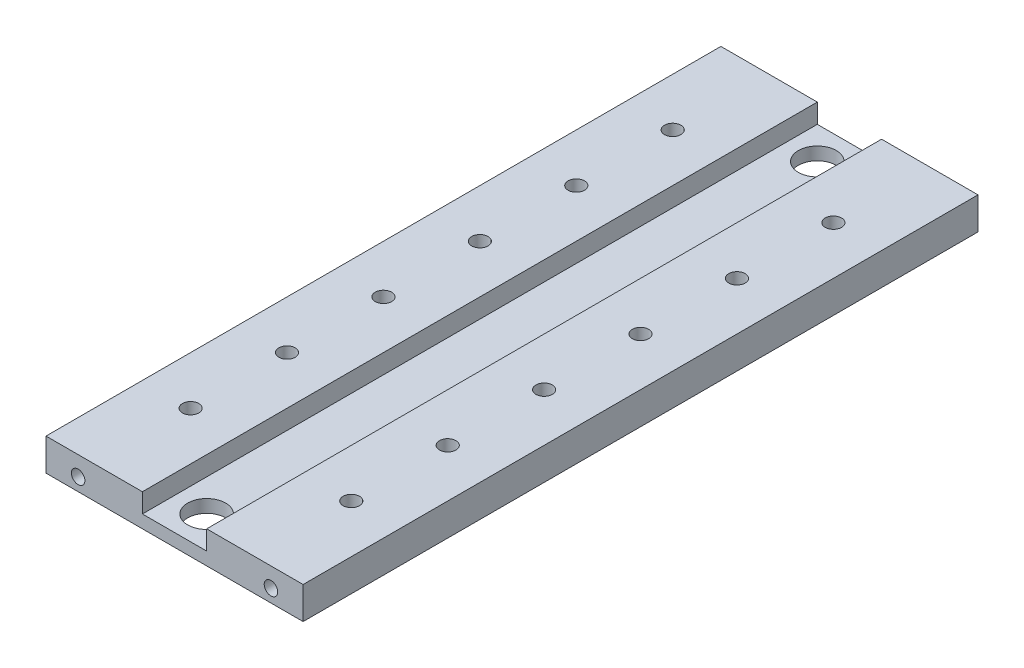
ISO-10303-21;
HEADER;
FILE_DESCRIPTION(('STEP AP214'),'2;1');
FILE_NAME('part.step','',(''),(''),'','','');
FILE_SCHEMA(('AUTOMOTIVE_DESIGN { 1 0 10303 214 1 1 1 1 }'));
ENDSEC;
DATA;
#1=APPLICATION_CONTEXT('core data for automotive mechanical design processes');
#2=APPLICATION_PROTOCOL_DEFINITION('international standard','automotive_design',2000,#1);
#3=PRODUCT_CONTEXT('',#1,'mechanical');
#4=PRODUCT('Part','Part','',(#3));
#5=PRODUCT_RELATED_PRODUCT_CATEGORY('part','',(#4));
#6=PRODUCT_DEFINITION_FORMATION('','',#4);
#7=PRODUCT_DEFINITION_CONTEXT('part definition',#1,'design');
#8=PRODUCT_DEFINITION('design','',#6,#7);
#9=PRODUCT_DEFINITION_SHAPE('','',#8);
#10=(LENGTH_UNIT() NAMED_UNIT(*) SI_UNIT(.MILLI.,.METRE.));
#11=(NAMED_UNIT(*) PLANE_ANGLE_UNIT() SI_UNIT($,.RADIAN.));
#12=(NAMED_UNIT(*) SI_UNIT($,.STERADIAN.) SOLID_ANGLE_UNIT());
#13=UNCERTAINTY_MEASURE_WITH_UNIT(LENGTH_MEASURE(1.E-05),#10,'distance_accuracy_value','');
#14=(GEOMETRIC_REPRESENTATION_CONTEXT(3) GLOBAL_UNCERTAINTY_ASSIGNED_CONTEXT((#13)) GLOBAL_UNIT_ASSIGNED_CONTEXT((#10,
#11,#12)) REPRESENTATION_CONTEXT('',''));
#15=CARTESIAN_POINT('',(0.,0.,0.));
#16=DIRECTION('',(0.,0.,1.));
#17=DIRECTION('',(1.,0.,0.));
#18=AXIS2_PLACEMENT_3D('',#15,#16,#17);
#19=CARTESIAN_POINT('',(-40.,10.,105.));
#20=DIRECTION('',(1.,0.,0.));
#21=DIRECTION('',(0.,0.,-1.));
#22=AXIS2_PLACEMENT_3D('',#19,#20,#21);
#23=PLANE('',#22);
#24=DIRECTION('',(0.,-1.,0.));
#25=VECTOR('',#24,1.);
#26=CARTESIAN_POINT('',(-40.,10.,-105.));
#27=LINE('',#26,#25);
#28=CARTESIAN_POINT('',(-40.,10.,-105.));
#29=VERTEX_POINT('',#28);
#30=CARTESIAN_POINT('',(-40.,0.,-105.));
#31=VERTEX_POINT('',#30);
#32=EDGE_CURVE('E137',#29,#31,#27,.T.);
#33=ORIENTED_EDGE('',*,*,#32,.T.);
#34=DIRECTION('',(0.,0.,-1.));
#35=VECTOR('',#34,1.);
#36=CARTESIAN_POINT('',(-40.,0.,105.));
#37=LINE('',#36,#35);
#38=CARTESIAN_POINT('',(-40.,0.,105.));
#39=VERTEX_POINT('',#38);
#40=EDGE_CURVE('E11',#39,#31,#37,.T.);
#41=ORIENTED_EDGE('',*,*,#40,.F.);
#42=DIRECTION('',(0.,-1.,0.));
#43=VECTOR('',#42,1.);
#44=CARTESIAN_POINT('',(-40.,10.,105.));
#45=LINE('',#44,#43);
#46=CARTESIAN_POINT('',(-40.,10.,105.));
#47=VERTEX_POINT('',#46);
#48=EDGE_CURVE('E152',#47,#39,#45,.T.);
#49=ORIENTED_EDGE('',*,*,#48,.F.);
#50=DIRECTION('',(0.,0.,-1.));
#51=VECTOR('',#50,1.);
#52=CARTESIAN_POINT('',(-40.,10.,105.));
#53=LINE('',#52,#51);
#54=EDGE_CURVE('E133',#47,#29,#53,.T.);
#55=ORIENTED_EDGE('',*,*,#54,.T.);
#56=EDGE_LOOP('',(#33,#41,#49,#55));
#57=FACE_BOUND('',#56,.T.);
#58=ADVANCED_FACE('F38',(#57),#23,.F.);
#59=CARTESIAN_POINT('',(-40.,0.,105.));
#60=DIRECTION('',(0.,1.,0.));
#61=DIRECTION('',(-1.,0.,0.));
#62=AXIS2_PLACEMENT_3D('',#59,#60,#61);
#63=PLANE('',#62);
#64=CARTESIAN_POINT('',(0.,0.,-95.));
#65=DIRECTION('',(0.,1.,0.));
#66=DIRECTION('',(0.,0.,1.));
#67=AXIS2_PLACEMENT_3D('',#64,#65,#66);
#68=CIRCLE('',#67,5.9);
#69=CARTESIAN_POINT('',(0.,0.,-89.1));
#70=VERTEX_POINT('',#69);
#71=EDGE_CURVE('E286',#70,#70,#68,.T.);
#72=ORIENTED_EDGE('',*,*,#71,.T.);
#73=EDGE_LOOP('',(#72));
#74=FACE_BOUND('',#73,.T.);
#75=CARTESIAN_POINT('',(0.,0.,95.));
#76=DIRECTION('',(0.,1.,0.));
#77=DIRECTION('',(0.,0.,1.));
#78=AXIS2_PLACEMENT_3D('',#75,#76,#77);
#79=CIRCLE('',#78,5.9);
#80=CARTESIAN_POINT('',(0.,0.,100.9));
#81=VERTEX_POINT('',#80);
#82=EDGE_CURVE('E267',#81,#81,#79,.T.);
#83=ORIENTED_EDGE('',*,*,#82,.T.);
#84=EDGE_LOOP('',(#83));
#85=FACE_BOUND('',#84,.T.);
#86=CARTESIAN_POINT('',(-25.,0.,15.));
#87=DIRECTION('',(0.,1.,0.));
#88=DIRECTION('',(-1.,0.,0.));
#89=AXIS2_PLACEMENT_3D('',#86,#87,#88);
#90=CIRCLE('',#89,2.55);
#91=CARTESIAN_POINT('',(-27.55,0.,15.));
#92=VERTEX_POINT('',#91);
#93=EDGE_CURVE('E242',#92,#92,#90,.T.);
#94=ORIENTED_EDGE('',*,*,#93,.T.);
#95=EDGE_LOOP('',(#94));
#96=FACE_BOUND('',#95,.T.);
#97=CARTESIAN_POINT('',(-25.,0.,45.));
#98=DIRECTION('',(0.,1.,0.));
#99=DIRECTION('',(-1.,0.,0.));
#100=AXIS2_PLACEMENT_3D('',#97,#98,#99);
#101=CIRCLE('',#100,2.55);
#102=CARTESIAN_POINT('',(-27.55,0.,45.));
#103=VERTEX_POINT('',#102);
#104=EDGE_CURVE('E249',#103,#103,#101,.T.);
#105=ORIENTED_EDGE('',*,*,#104,.T.);
#106=EDGE_LOOP('',(#105));
#107=FACE_BOUND('',#106,.T.);
#108=CARTESIAN_POINT('',(-25.,0.,75.));
#109=DIRECTION('',(0.,1.,0.));
#110=DIRECTION('',(-1.,0.,0.));
#111=AXIS2_PLACEMENT_3D('',#108,#109,#110);
#112=CIRCLE('',#111,2.55);
#113=CARTESIAN_POINT('',(-27.55,0.,75.));
#114=VERTEX_POINT('',#113);
#115=EDGE_CURVE('E255',#114,#114,#112,.T.);
#116=ORIENTED_EDGE('',*,*,#115,.T.);
#117=EDGE_LOOP('',(#116));
#118=FACE_BOUND('',#117,.T.);
#119=CARTESIAN_POINT('',(25.,0.,75.));
#120=DIRECTION('',(0.,1.,0.));
#121=DIRECTION('',(1.,0.,0.));
#122=AXIS2_PLACEMENT_3D('',#119,#120,#121);
#123=CIRCLE('',#122,2.55);
#124=CARTESIAN_POINT('',(27.55,0.,75.));
#125=VERTEX_POINT('',#124);
#126=EDGE_CURVE('E219',#125,#125,#123,.T.);
#127=ORIENTED_EDGE('',*,*,#126,.T.);
#128=EDGE_LOOP('',(#127));
#129=FACE_BOUND('',#128,.T.);
#130=CARTESIAN_POINT('',(25.,0.,45.));
#131=DIRECTION('',(0.,1.,0.));
#132=DIRECTION('',(1.,0.,0.));
#133=AXIS2_PLACEMENT_3D('',#130,#131,#132);
#134=CIRCLE('',#133,2.55);
#135=CARTESIAN_POINT('',(27.55,0.,45.));
#136=VERTEX_POINT('',#135);
#137=EDGE_CURVE('E218',#136,#136,#134,.T.);
#138=ORIENTED_EDGE('',*,*,#137,.T.);
#139=EDGE_LOOP('',(#138));
#140=FACE_BOUND('',#139,.T.);
#141=CARTESIAN_POINT('',(25.,0.,15.));
#142=DIRECTION('',(0.,1.,0.));
#143=DIRECTION('',(1.,0.,0.));
#144=AXIS2_PLACEMENT_3D('',#141,#142,#143);
#145=CIRCLE('',#144,2.55);
#146=CARTESIAN_POINT('',(27.55,0.,15.));
#147=VERTEX_POINT('',#146);
#148=EDGE_CURVE('E225',#147,#147,#145,.T.);
#149=ORIENTED_EDGE('',*,*,#148,.T.);
#150=EDGE_LOOP('',(#149));
#151=FACE_BOUND('',#150,.T.);
#152=CARTESIAN_POINT('',(25.,0.,-15.));
#153=DIRECTION('',(0.,1.,0.));
#154=DIRECTION('',(-1.,0.,0.));
#155=AXIS2_PLACEMENT_3D('',#152,#153,#154);
#156=CIRCLE('',#155,2.55);
#157=CARTESIAN_POINT('',(22.45,0.,-15.));
#158=VERTEX_POINT('',#157);
#159=EDGE_CURVE('E231',#158,#158,#156,.T.);
#160=ORIENTED_EDGE('',*,*,#159,.T.);
#161=EDGE_LOOP('',(#160));
#162=FACE_BOUND('',#161,.T.);
#163=CARTESIAN_POINT('',(25.,0.,-45.));
#164=DIRECTION('',(0.,1.,0.));
#165=DIRECTION('',(-1.,0.,0.));
#166=AXIS2_PLACEMENT_3D('',#163,#164,#165);
#167=CIRCLE('',#166,2.55);
#168=CARTESIAN_POINT('',(22.45,0.,-45.));
#169=VERTEX_POINT('',#168);
#170=EDGE_CURVE('E212',#169,#169,#167,.T.);
#171=ORIENTED_EDGE('',*,*,#170,.T.);
#172=EDGE_LOOP('',(#171));
#173=FACE_BOUND('',#172,.T.);
#174=CARTESIAN_POINT('',(-25.,0.,-15.));
#175=DIRECTION('',(0.,1.,0.));
#176=DIRECTION('',(1.,0.,0.));
#177=AXIS2_PLACEMENT_3D('',#174,#175,#176);
#178=CIRCLE('',#177,2.55);
#179=CARTESIAN_POINT('',(-22.45,0.,-15.));
#180=VERTEX_POINT('',#179);
#181=EDGE_CURVE('E243',#180,#180,#178,.T.);
#182=ORIENTED_EDGE('',*,*,#181,.T.);
#183=EDGE_LOOP('',(#182));
#184=FACE_BOUND('',#183,.T.);
#185=CARTESIAN_POINT('',(-25.,0.,-45.));
#186=DIRECTION('',(0.,1.,0.));
#187=DIRECTION('',(1.,0.,0.));
#188=AXIS2_PLACEMENT_3D('',#185,#186,#187);
#189=CIRCLE('',#188,2.55);
#190=CARTESIAN_POINT('',(-22.45,0.,-45.));
#191=VERTEX_POINT('',#190);
#192=EDGE_CURVE('E273',#191,#191,#189,.T.);
#193=ORIENTED_EDGE('',*,*,#192,.T.);
#194=EDGE_LOOP('',(#193));
#195=FACE_BOUND('',#194,.T.);
#196=CARTESIAN_POINT('',(-25.,0.,-75.));
#197=DIRECTION('',(0.,1.,0.));
#198=DIRECTION('',(1.,0.,0.));
#199=AXIS2_PLACEMENT_3D('',#196,#197,#198);
#200=CIRCLE('',#199,2.55);
#201=CARTESIAN_POINT('',(-22.45,0.,-75.));
#202=VERTEX_POINT('',#201);
#203=EDGE_CURVE('E266',#202,#202,#200,.T.);
#204=ORIENTED_EDGE('',*,*,#203,.T.);
#205=EDGE_LOOP('',(#204));
#206=FACE_BOUND('',#205,.T.);
#207=CARTESIAN_POINT('',(25.,0.,-75.));
#208=DIRECTION('',(0.,1.,0.));
#209=DIRECTION('',(-1.,0.,0.));
#210=AXIS2_PLACEMENT_3D('',#207,#208,#209);
#211=CIRCLE('',#210,2.55);
#212=CARTESIAN_POINT('',(22.45,0.,-75.));
#213=VERTEX_POINT('',#212);
#214=EDGE_CURVE('E208',#213,#213,#211,.T.);
#215=ORIENTED_EDGE('',*,*,#214,.T.);
#216=EDGE_LOOP('',(#215));
#217=FACE_BOUND('',#216,.T.);
#218=DIRECTION('',(1.,0.,0.));
#219=VECTOR('',#218,1.);
#220=CARTESIAN_POINT('',(-40.,0.,-105.));
#221=LINE('',#220,#219);
#222=CARTESIAN_POINT('',(40.,0.,-105.));
#223=VERTEX_POINT('',#222);
#224=EDGE_CURVE('E140',#31,#223,#221,.T.);
#225=ORIENTED_EDGE('',*,*,#224,.T.);
#226=DIRECTION('',(0.,0.,-1.));
#227=VECTOR('',#226,1.);
#228=CARTESIAN_POINT('',(40.,0.,105.));
#229=LINE('',#228,#227);
#230=CARTESIAN_POINT('',(40.,0.,105.));
#231=VERTEX_POINT('',#230);
#232=EDGE_CURVE('E46',#231,#223,#229,.T.);
#233=ORIENTED_EDGE('',*,*,#232,.F.);
#234=DIRECTION('',(1.,0.,0.));
#235=VECTOR('',#234,1.);
#236=CARTESIAN_POINT('',(-40.,0.,105.));
#237=LINE('',#236,#235);
#238=EDGE_CURVE('E98',#39,#231,#237,.T.);
#239=ORIENTED_EDGE('',*,*,#238,.F.);
#240=ORIENTED_EDGE('',*,*,#40,.T.);
#241=EDGE_LOOP('',(#225,#233,#239,#240));
#242=FACE_BOUND('',#241,.T.);
#243=ADVANCED_FACE('F317',(#74,#85,#96,#107,#118,#129,#140,#151,#162,#173,#184,#195,#206,#217,
#242),#63,.F.);
#244=CARTESIAN_POINT('',(40.,0.,105.));
#245=DIRECTION('',(-1.,0.,0.));
#246=DIRECTION('',(0.,0.,1.));
#247=AXIS2_PLACEMENT_3D('',#244,#245,#246);
#248=PLANE('',#247);
#249=DIRECTION('',(0.,1.,0.));
#250=VECTOR('',#249,1.);
#251=CARTESIAN_POINT('',(40.,0.,-105.));
#252=LINE('',#251,#250);
#253=CARTESIAN_POINT('',(40.,10.,-105.));
#254=VERTEX_POINT('',#253);
#255=EDGE_CURVE('E143',#223,#254,#252,.T.);
#256=ORIENTED_EDGE('',*,*,#255,.T.);
#257=DIRECTION('',(0.,0.,-1.));
#258=VECTOR('',#257,1.);
#259=CARTESIAN_POINT('',(40.,10.,105.));
#260=LINE('',#259,#258);
#261=CARTESIAN_POINT('',(40.,10.,105.));
#262=VERTEX_POINT('',#261);
#263=EDGE_CURVE('E159',#262,#254,#260,.T.);
#264=ORIENTED_EDGE('',*,*,#263,.F.);
#265=DIRECTION('',(0.,1.,0.));
#266=VECTOR('',#265,1.);
#267=CARTESIAN_POINT('',(40.,0.,105.));
#268=LINE('',#267,#266);
#269=EDGE_CURVE('E167',#231,#262,#268,.T.);
#270=ORIENTED_EDGE('',*,*,#269,.F.);
#271=ORIENTED_EDGE('',*,*,#232,.T.);
#272=EDGE_LOOP('',(#256,#264,#270,#271));
#273=FACE_BOUND('',#272,.T.);
#274=ADVANCED_FACE('F165',(#273),#248,.F.);
#275=CARTESIAN_POINT('',(40.,10.,105.));
#276=DIRECTION('',(0.,-1.,0.));
#277=DIRECTION('',(1.,0.,0.));
#278=AXIS2_PLACEMENT_3D('',#275,#276,#277);
#279=PLANE('',#278);
#280=CARTESIAN_POINT('',(25.,10.,75.));
#281=DIRECTION('',(0.,1.,0.));
#282=DIRECTION('',(1.,0.,0.));
#283=AXIS2_PLACEMENT_3D('',#280,#281,#282);
#284=CIRCLE('',#283,2.55);
#285=CARTESIAN_POINT('',(27.55,10.,75.));
#286=VERTEX_POINT('',#285);
#287=EDGE_CURVE('E258',#286,#286,#284,.T.);
#288=ORIENTED_EDGE('',*,*,#287,.F.);
#289=EDGE_LOOP('',(#288));
#290=FACE_BOUND('',#289,.T.);
#291=CARTESIAN_POINT('',(25.,10.,45.));
#292=DIRECTION('',(0.,1.,0.));
#293=DIRECTION('',(1.,0.,0.));
#294=AXIS2_PLACEMENT_3D('',#291,#292,#293);
#295=CIRCLE('',#294,2.55);
#296=CARTESIAN_POINT('',(27.55,10.,45.));
#297=VERTEX_POINT('',#296);
#298=EDGE_CURVE('E215',#297,#297,#295,.T.);
#299=ORIENTED_EDGE('',*,*,#298,.F.);
#300=EDGE_LOOP('',(#299));
#301=FACE_BOUND('',#300,.T.);
#302=CARTESIAN_POINT('',(25.,10.,15.));
#303=DIRECTION('',(0.,1.,0.));
#304=DIRECTION('',(1.,0.,0.));
#305=AXIS2_PLACEMENT_3D('',#302,#303,#304);
#306=CIRCLE('',#305,2.55);
#307=CARTESIAN_POINT('',(27.55,10.,15.));
#308=VERTEX_POINT('',#307);
#309=EDGE_CURVE('E222',#308,#308,#306,.T.);
#310=ORIENTED_EDGE('',*,*,#309,.F.);
#311=EDGE_LOOP('',(#310));
#312=FACE_BOUND('',#311,.T.);
#313=CARTESIAN_POINT('',(25.,10.,-15.));
#314=DIRECTION('',(0.,1.,0.));
#315=DIRECTION('',(-1.,0.,0.));
#316=AXIS2_PLACEMENT_3D('',#313,#314,#315);
#317=CIRCLE('',#316,2.55);
#318=CARTESIAN_POINT('',(22.45,10.,-15.));
#319=VERTEX_POINT('',#318);
#320=EDGE_CURVE('E228',#319,#319,#317,.T.);
#321=ORIENTED_EDGE('',*,*,#320,.F.);
#322=EDGE_LOOP('',(#321));
#323=FACE_BOUND('',#322,.T.);
#324=CARTESIAN_POINT('',(25.,10.,-45.));
#325=DIRECTION('',(0.,1.,0.));
#326=DIRECTION('',(-1.,0.,0.));
#327=AXIS2_PLACEMENT_3D('',#324,#325,#326);
#328=CIRCLE('',#327,2.55);
#329=CARTESIAN_POINT('',(22.45,10.,-45.));
#330=VERTEX_POINT('',#329);
#331=EDGE_CURVE('E234',#330,#330,#328,.T.);
#332=ORIENTED_EDGE('',*,*,#331,.F.);
#333=EDGE_LOOP('',(#332));
#334=FACE_BOUND('',#333,.T.);
#335=CARTESIAN_POINT('',(25.,10.,-75.));
#336=DIRECTION('',(0.,1.,0.));
#337=DIRECTION('',(-1.,0.,0.));
#338=AXIS2_PLACEMENT_3D('',#335,#336,#337);
#339=CIRCLE('',#338,2.55);
#340=CARTESIAN_POINT('',(22.45,10.,-75.));
#341=VERTEX_POINT('',#340);
#342=EDGE_CURVE('E209',#341,#341,#339,.T.);
#343=ORIENTED_EDGE('',*,*,#342,.F.);
#344=EDGE_LOOP('',(#343));
#345=FACE_BOUND('',#344,.T.);
#346=DIRECTION('',(-1.,0.,0.));
#347=VECTOR('',#346,1.);
#348=CARTESIAN_POINT('',(40.,10.,-105.));
#349=LINE('',#348,#347);
#350=CARTESIAN_POINT('',(10.,10.,-105.));
#351=VERTEX_POINT('',#350);
#352=EDGE_CURVE('E145',#254,#351,#349,.T.);
#353=ORIENTED_EDGE('',*,*,#352,.T.);
#354=DIRECTION('',(0.,0.,-1.));
#355=VECTOR('',#354,1.);
#356=CARTESIAN_POINT('',(10.,10.,105.));
#357=LINE('',#356,#355);
#358=CARTESIAN_POINT('',(10.,10.,105.));
#359=VERTEX_POINT('',#358);
#360=EDGE_CURVE('E156',#359,#351,#357,.T.);
#361=ORIENTED_EDGE('',*,*,#360,.F.);
#362=DIRECTION('',(-1.,0.,0.));
#363=VECTOR('',#362,1.);
#364=CARTESIAN_POINT('',(40.,10.,105.));
#365=LINE('',#364,#363);
#366=EDGE_CURVE('E179',#262,#359,#365,.T.);
#367=ORIENTED_EDGE('',*,*,#366,.F.);
#368=ORIENTED_EDGE('',*,*,#263,.T.);
#369=EDGE_LOOP('',(#353,#361,#367,#368));
#370=FACE_BOUND('',#369,.T.);
#371=ADVANCED_FACE('F175',(#290,#301,#312,#323,#334,#345,#370),#279,.F.);
#372=CARTESIAN_POINT('',(10.,10.,105.));
#373=DIRECTION('',(1.,0.,0.));
#374=DIRECTION('',(0.,1.,0.));
#375=AXIS2_PLACEMENT_3D('',#372,#373,#374);
#376=PLANE('',#375);
#377=DIRECTION('',(0.,-1.,0.));
#378=VECTOR('',#377,1.);
#379=CARTESIAN_POINT('',(10.,10.,-105.));
#380=LINE('',#379,#378);
#381=CARTESIAN_POINT('',(10.,4.,-105.));
#382=VERTEX_POINT('',#381);
#383=EDGE_CURVE('E147',#351,#382,#380,.T.);
#384=ORIENTED_EDGE('',*,*,#383,.T.);
#385=DIRECTION('',(0.,0.,-1.));
#386=VECTOR('',#385,1.);
#387=CARTESIAN_POINT('',(10.,4.,105.));
#388=LINE('',#387,#386);
#389=CARTESIAN_POINT('',(10.,4.,105.));
#390=VERTEX_POINT('',#389);
#391=EDGE_CURVE('E128',#390,#382,#388,.T.);
#392=ORIENTED_EDGE('',*,*,#391,.F.);
#393=DIRECTION('',(0.,-1.,0.));
#394=VECTOR('',#393,1.);
#395=CARTESIAN_POINT('',(10.,10.,105.));
#396=LINE('',#395,#394);
#397=EDGE_CURVE('E119',#359,#390,#396,.T.);
#398=ORIENTED_EDGE('',*,*,#397,.F.);
#399=ORIENTED_EDGE('',*,*,#360,.T.);
#400=EDGE_LOOP('',(#384,#392,#398,#399));
#401=FACE_BOUND('',#400,.T.);
#402=ADVANCED_FACE('F178',(#401),#376,.F.);
#403=CARTESIAN_POINT('',(10.,4.,105.));
#404=DIRECTION('',(0.,-1.,0.));
#405=DIRECTION('',(0.,0.,-1.));
#406=AXIS2_PLACEMENT_3D('',#403,#404,#405);
#407=PLANE('',#406);
#408=CARTESIAN_POINT('',(0.,4.,-95.));
#409=DIRECTION('',(0.,1.,0.));
#410=DIRECTION('',(0.,0.,1.));
#411=AXIS2_PLACEMENT_3D('',#408,#409,#410);
#412=CIRCLE('',#411,5.9);
#413=CARTESIAN_POINT('',(0.,4.,-89.1));
#414=VERTEX_POINT('',#413);
#415=EDGE_CURVE('E289',#414,#414,#412,.T.);
#416=ORIENTED_EDGE('',*,*,#415,.F.);
#417=EDGE_LOOP('',(#416));
#418=FACE_BOUND('',#417,.T.);
#419=CARTESIAN_POINT('',(0.,4.,95.));
#420=DIRECTION('',(0.,1.,0.));
#421=DIRECTION('',(0.,0.,1.));
#422=AXIS2_PLACEMENT_3D('',#419,#420,#421);
#423=CIRCLE('',#422,5.9);
#424=CARTESIAN_POINT('',(0.,4.,100.9));
#425=VERTEX_POINT('',#424);
#426=EDGE_CURVE('E283',#425,#425,#423,.T.);
#427=ORIENTED_EDGE('',*,*,#426,.F.);
#428=EDGE_LOOP('',(#427));
#429=FACE_BOUND('',#428,.T.);
#430=DIRECTION('',(-1.,0.,0.));
#431=VECTOR('',#430,1.);
#432=CARTESIAN_POINT('',(10.,4.,-105.));
#433=LINE('',#432,#431);
#434=CARTESIAN_POINT('',(-10.,4.,-105.));
#435=VERTEX_POINT('',#434);
#436=EDGE_CURVE('E127',#382,#435,#433,.T.);
#437=ORIENTED_EDGE('',*,*,#436,.T.);
#438=DIRECTION('',(0.,0.,-1.));
#439=VECTOR('',#438,1.);
#440=CARTESIAN_POINT('',(-10.,4.,105.));
#441=LINE('',#440,#439);
#442=CARTESIAN_POINT('',(-10.,4.,105.));
#443=VERTEX_POINT('',#442);
#444=EDGE_CURVE('E124',#443,#435,#441,.T.);
#445=ORIENTED_EDGE('',*,*,#444,.F.);
#446=DIRECTION('',(-1.,0.,0.));
#447=VECTOR('',#446,1.);
#448=CARTESIAN_POINT('',(10.,4.,105.));
#449=LINE('',#448,#447);
#450=EDGE_CURVE('E113',#390,#443,#449,.T.);
#451=ORIENTED_EDGE('',*,*,#450,.F.);
#452=ORIENTED_EDGE('',*,*,#391,.T.);
#453=EDGE_LOOP('',(#437,#445,#451,#452));
#454=FACE_BOUND('',#453,.T.);
#455=ADVANCED_FACE('F125',(#418,#429,#454),#407,.F.);
#456=CARTESIAN_POINT('',(-10.,4.,105.));
#457=DIRECTION('',(-1.,0.,0.));
#458=DIRECTION('',(0.,-1.,0.));
#459=AXIS2_PLACEMENT_3D('',#456,#457,#458);
#460=PLANE('',#459);
#461=DIRECTION('',(0.,1.,0.));
#462=VECTOR('',#461,1.);
#463=CARTESIAN_POINT('',(-10.,4.,-105.));
#464=LINE('',#463,#462);
#465=CARTESIAN_POINT('',(-10.,10.,-105.));
#466=VERTEX_POINT('',#465);
#467=EDGE_CURVE('E84',#435,#466,#464,.T.);
#468=ORIENTED_EDGE('',*,*,#467,.T.);
#469=DIRECTION('',(0.,0.,-1.));
#470=VECTOR('',#469,1.);
#471=CARTESIAN_POINT('',(-10.,10.,105.));
#472=LINE('',#471,#470);
#473=CARTESIAN_POINT('',(-10.,10.,105.));
#474=VERTEX_POINT('',#473);
#475=EDGE_CURVE('E129',#474,#466,#472,.T.);
#476=ORIENTED_EDGE('',*,*,#475,.F.);
#477=DIRECTION('',(0.,1.,0.));
#478=VECTOR('',#477,1.);
#479=CARTESIAN_POINT('',(-10.,4.,105.));
#480=LINE('',#479,#478);
#481=EDGE_CURVE('E117',#443,#474,#480,.T.);
#482=ORIENTED_EDGE('',*,*,#481,.F.);
#483=ORIENTED_EDGE('',*,*,#444,.T.);
#484=EDGE_LOOP('',(#468,#476,#482,#483));
#485=FACE_BOUND('',#484,.T.);
#486=ADVANCED_FACE('F131',(#485),#460,.F.);
#487=CARTESIAN_POINT('',(-10.,10.,105.));
#488=DIRECTION('',(0.,-1.,0.));
#489=DIRECTION('',(1.,0.,0.));
#490=AXIS2_PLACEMENT_3D('',#487,#488,#489);
#491=PLANE('',#490);
#492=CARTESIAN_POINT('',(-25.,10.,15.));
#493=DIRECTION('',(0.,1.,0.));
#494=DIRECTION('',(-1.,0.,0.));
#495=AXIS2_PLACEMENT_3D('',#492,#493,#494);
#496=CIRCLE('',#495,2.55);
#497=CARTESIAN_POINT('',(-27.55,10.,15.));
#498=VERTEX_POINT('',#497);
#499=EDGE_CURVE('E239',#498,#498,#496,.T.);
#500=ORIENTED_EDGE('',*,*,#499,.F.);
#501=EDGE_LOOP('',(#500));
#502=FACE_BOUND('',#501,.T.);
#503=CARTESIAN_POINT('',(-25.,10.,45.));
#504=DIRECTION('',(0.,1.,0.));
#505=DIRECTION('',(-1.,0.,0.));
#506=AXIS2_PLACEMENT_3D('',#503,#504,#505);
#507=CIRCLE('',#506,2.55);
#508=CARTESIAN_POINT('',(-27.55,10.,45.));
#509=VERTEX_POINT('',#508);
#510=EDGE_CURVE('E246',#509,#509,#507,.T.);
#511=ORIENTED_EDGE('',*,*,#510,.F.);
#512=EDGE_LOOP('',(#511));
#513=FACE_BOUND('',#512,.T.);
#514=CARTESIAN_POINT('',(-25.,10.,75.));
#515=DIRECTION('',(0.,1.,0.));
#516=DIRECTION('',(-1.,0.,0.));
#517=AXIS2_PLACEMENT_3D('',#514,#515,#516);
#518=CIRCLE('',#517,2.55);
#519=CARTESIAN_POINT('',(-27.55,10.,75.));
#520=VERTEX_POINT('',#519);
#521=EDGE_CURVE('E252',#520,#520,#518,.T.);
#522=ORIENTED_EDGE('',*,*,#521,.F.);
#523=EDGE_LOOP('',(#522));
#524=FACE_BOUND('',#523,.T.);
#525=CARTESIAN_POINT('',(-25.,10.,-15.));
#526=DIRECTION('',(0.,1.,0.));
#527=DIRECTION('',(1.,0.,0.));
#528=AXIS2_PLACEMENT_3D('',#525,#526,#527);
#529=CIRCLE('',#528,2.55);
#530=CARTESIAN_POINT('',(-22.45,10.,-15.));
#531=VERTEX_POINT('',#530);
#532=EDGE_CURVE('E276',#531,#531,#529,.T.);
#533=ORIENTED_EDGE('',*,*,#532,.F.);
#534=EDGE_LOOP('',(#533));
#535=FACE_BOUND('',#534,.T.);
#536=CARTESIAN_POINT('',(-25.,10.,-45.));
#537=DIRECTION('',(0.,1.,0.));
#538=DIRECTION('',(1.,0.,0.));
#539=AXIS2_PLACEMENT_3D('',#536,#537,#538);
#540=CIRCLE('',#539,2.55);
#541=CARTESIAN_POINT('',(-22.45,10.,-45.));
#542=VERTEX_POINT('',#541);
#543=EDGE_CURVE('E270',#542,#542,#540,.T.);
#544=ORIENTED_EDGE('',*,*,#543,.F.);
#545=EDGE_LOOP('',(#544));
#546=FACE_BOUND('',#545,.T.);
#547=CARTESIAN_POINT('',(-25.,10.,-75.));
#548=DIRECTION('',(0.,1.,0.));
#549=DIRECTION('',(1.,0.,0.));
#550=AXIS2_PLACEMENT_3D('',#547,#548,#549);
#551=CIRCLE('',#550,2.55);
#552=CARTESIAN_POINT('',(-22.45,10.,-75.));
#553=VERTEX_POINT('',#552);
#554=EDGE_CURVE('E263',#553,#553,#551,.T.);
#555=ORIENTED_EDGE('',*,*,#554,.F.);
#556=EDGE_LOOP('',(#555));
#557=FACE_BOUND('',#556,.T.);
#558=DIRECTION('',(-1.,0.,0.));
#559=VECTOR('',#558,1.);
#560=CARTESIAN_POINT('',(-10.,10.,-105.));
#561=LINE('',#560,#559);
#562=EDGE_CURVE('E90',#466,#29,#561,.T.);
#563=ORIENTED_EDGE('',*,*,#562,.T.);
#564=ORIENTED_EDGE('',*,*,#54,.F.);
#565=DIRECTION('',(-1.,0.,0.));
#566=VECTOR('',#565,1.);
#567=CARTESIAN_POINT('',(-10.,10.,105.));
#568=LINE('',#567,#566);
#569=EDGE_CURVE('E54',#474,#47,#568,.T.);
#570=ORIENTED_EDGE('',*,*,#569,.F.);
#571=ORIENTED_EDGE('',*,*,#475,.T.);
#572=EDGE_LOOP('',(#563,#564,#570,#571));
#573=FACE_BOUND('',#572,.T.);
#574=ADVANCED_FACE('F325',(#502,#513,#524,#535,#546,#557,#573),#491,.F.);
#575=CARTESIAN_POINT('',(0.,0.,105.));
#576=DIRECTION('',(0.,0.,1.));
#577=DIRECTION('',(1.,0.,0.));
#578=AXIS2_PLACEMENT_3D('',#575,#576,#577);
#579=PLANE('',#578);
#580=CARTESIAN_POINT('',(-30.,4.,105.));
#581=DIRECTION('',(0.,0.,1.));
#582=DIRECTION('',(1.,0.,0.));
#583=AXIS2_PLACEMENT_3D('',#580,#581,#582);
#584=CIRCLE('',#583,2.09999999999999);
#585=CARTESIAN_POINT('',(-27.9,4.,105.));
#586=VERTEX_POINT('',#585);
#587=EDGE_CURVE('E193',#586,#586,#584,.T.);
#588=ORIENTED_EDGE('',*,*,#587,.F.);
#589=EDGE_LOOP('',(#588));
#590=FACE_BOUND('',#589,.T.);
#591=CARTESIAN_POINT('',(30.,4.,105.));
#592=DIRECTION('',(0.,0.,1.));
#593=DIRECTION('',(1.,0.,0.));
#594=AXIS2_PLACEMENT_3D('',#591,#592,#593);
#595=CIRCLE('',#594,2.09999999999999);
#596=CARTESIAN_POINT('',(32.1,4.,105.));
#597=VERTEX_POINT('',#596);
#598=EDGE_CURVE('E187',#597,#597,#595,.T.);
#599=ORIENTED_EDGE('',*,*,#598,.F.);
#600=EDGE_LOOP('',(#599));
#601=FACE_BOUND('',#600,.T.);
#602=ORIENTED_EDGE('',*,*,#48,.T.);
#603=ORIENTED_EDGE('',*,*,#238,.T.);
#604=ORIENTED_EDGE('',*,*,#269,.T.);
#605=ORIENTED_EDGE('',*,*,#366,.T.);
#606=ORIENTED_EDGE('',*,*,#397,.T.);
#607=ORIENTED_EDGE('',*,*,#450,.T.);
#608=ORIENTED_EDGE('',*,*,#481,.T.);
#609=ORIENTED_EDGE('',*,*,#569,.T.);
#610=EDGE_LOOP('',(#602,#603,#604,#605,#606,#607,#608,#609));
#611=FACE_BOUND('',#610,.T.);
#612=ADVANCED_FACE('F115',(#590,#601,#611),#579,.T.);
#613=CARTESIAN_POINT('',(0.,0.,-105.));
#614=DIRECTION('',(0.,0.,1.));
#615=DIRECTION('',(1.,0.,0.));
#616=AXIS2_PLACEMENT_3D('',#613,#614,#615);
#617=PLANE('',#616);
#618=CARTESIAN_POINT('',(25.,4.,-105.));
#619=DIRECTION('',(0.,0.,-1.));
#620=DIRECTION('',(-1.,0.,0.));
#621=AXIS2_PLACEMENT_3D('',#618,#619,#620);
#622=CIRCLE('',#621,2.09999999999999);
#623=CARTESIAN_POINT('',(22.9,4.,-105.));
#624=VERTEX_POINT('',#623);
#625=EDGE_CURVE('E205',#624,#624,#622,.T.);
#626=ORIENTED_EDGE('',*,*,#625,.F.);
#627=EDGE_LOOP('',(#626));
#628=FACE_BOUND('',#627,.T.);
#629=CARTESIAN_POINT('',(-25.,4.,-105.));
#630=DIRECTION('',(0.,0.,-1.));
#631=DIRECTION('',(-1.,0.,0.));
#632=AXIS2_PLACEMENT_3D('',#629,#630,#631);
#633=CIRCLE('',#632,2.09999999999999);
#634=CARTESIAN_POINT('',(-27.1,4.,-105.));
#635=VERTEX_POINT('',#634);
#636=EDGE_CURVE('E199',#635,#635,#633,.T.);
#637=ORIENTED_EDGE('',*,*,#636,.F.);
#638=EDGE_LOOP('',(#637));
#639=FACE_BOUND('',#638,.T.);
#640=ORIENTED_EDGE('',*,*,#32,.F.);
#641=ORIENTED_EDGE('',*,*,#562,.F.);
#642=ORIENTED_EDGE('',*,*,#467,.F.);
#643=ORIENTED_EDGE('',*,*,#436,.F.);
#644=ORIENTED_EDGE('',*,*,#383,.F.);
#645=ORIENTED_EDGE('',*,*,#352,.F.);
#646=ORIENTED_EDGE('',*,*,#255,.F.);
#647=ORIENTED_EDGE('',*,*,#224,.F.);
#648=EDGE_LOOP('',(#640,#641,#642,#643,#644,#645,#646,#647));
#649=FACE_BOUND('',#648,.T.);
#650=ADVANCED_FACE('F171',(#628,#639,#649),#617,.F.);
#651=CARTESIAN_POINT('',(30.,4.,91.));
#652=DIRECTION('',(0.,0.,1.));
#653=DIRECTION('',(1.,0.,0.));
#654=AXIS2_PLACEMENT_3D('',#651,#652,#653);
#655=CONICAL_SURFACE('',#654,2.09999999999999,1.02974425867665);
#656=CARTESIAN_POINT('',(30.,4.,89.7381927000421));
#657=VERTEX_POINT('',#656);
#658=VERTEX_LOOP('',#657);
#659=FACE_BOUND('',#658,.T.);
#660=CARTESIAN_POINT('',(30.,4.,91.));
#661=DIRECTION('',(0.,0.,1.));
#662=DIRECTION('',(1.,0.,0.));
#663=AXIS2_PLACEMENT_3D('',#660,#661,#662);
#664=CIRCLE('',#663,2.09999999999999);
#665=CARTESIAN_POINT('',(32.1,4.,91.));
#666=VERTEX_POINT('',#665);
#667=EDGE_CURVE('E141',#666,#666,#664,.T.);
#668=ORIENTED_EDGE('',*,*,#667,.T.);
#669=EDGE_LOOP('',(#668));
#670=FACE_BOUND('',#669,.T.);
#671=ADVANCED_FACE('F385',(#659,#670),#655,.F.);
#672=CARTESIAN_POINT('',(30.,4.,105.));
#673=DIRECTION('',(0.,0.,1.));
#674=DIRECTION('',(1.,0.,0.));
#675=AXIS2_PLACEMENT_3D('',#672,#673,#674);
#676=CYLINDRICAL_SURFACE('',#675,2.09999999999999);
#677=ORIENTED_EDGE('',*,*,#667,.F.);
#678=EDGE_LOOP('',(#677));
#679=FACE_BOUND('',#678,.T.);
#680=ORIENTED_EDGE('',*,*,#598,.T.);
#681=EDGE_LOOP('',(#680));
#682=FACE_BOUND('',#681,.T.);
#683=ADVANCED_FACE('F390',(#679,#682),#676,.F.);
#684=CARTESIAN_POINT('',(-30.,4.,91.));
#685=DIRECTION('',(0.,0.,1.));
#686=DIRECTION('',(1.,0.,0.));
#687=AXIS2_PLACEMENT_3D('',#684,#685,#686);
#688=CONICAL_SURFACE('',#687,2.09999999999999,1.02974425867665);
#689=CARTESIAN_POINT('',(-30.,4.,89.7381927000421));
#690=VERTEX_POINT('',#689);
#691=VERTEX_LOOP('',#690);
#692=FACE_BOUND('',#691,.T.);
#693=CARTESIAN_POINT('',(-30.,4.,91.));
#694=DIRECTION('',(0.,0.,1.));
#695=DIRECTION('',(1.,0.,0.));
#696=AXIS2_PLACEMENT_3D('',#693,#694,#695);
#697=CIRCLE('',#696,2.09999999999999);
#698=CARTESIAN_POINT('',(-27.9,4.,91.));
#699=VERTEX_POINT('',#698);
#700=EDGE_CURVE('E190',#699,#699,#697,.T.);
#701=ORIENTED_EDGE('',*,*,#700,.T.);
#702=EDGE_LOOP('',(#701));
#703=FACE_BOUND('',#702,.T.);
#704=ADVANCED_FACE('F403',(#692,#703),#688,.F.);
#705=CARTESIAN_POINT('',(-30.,4.,105.));
#706=DIRECTION('',(0.,0.,1.));
#707=DIRECTION('',(1.,0.,0.));
#708=AXIS2_PLACEMENT_3D('',#705,#706,#707);
#709=CYLINDRICAL_SURFACE('',#708,2.09999999999999);
#710=ORIENTED_EDGE('',*,*,#700,.F.);
#711=EDGE_LOOP('',(#710));
#712=FACE_BOUND('',#711,.T.);
#713=ORIENTED_EDGE('',*,*,#587,.T.);
#714=EDGE_LOOP('',(#713));
#715=FACE_BOUND('',#714,.T.);
#716=ADVANCED_FACE('F414',(#712,#715),#709,.F.);
#717=CARTESIAN_POINT('',(-25.,4.,-91.));
#718=DIRECTION('',(0.,0.,-1.));
#719=DIRECTION('',(-1.,0.,0.));
#720=AXIS2_PLACEMENT_3D('',#717,#718,#719);
#721=CONICAL_SURFACE('',#720,2.09999999999999,1.02974425867665);
#722=CARTESIAN_POINT('',(-25.,4.,-89.7381927000421));
#723=VERTEX_POINT('',#722);
#724=VERTEX_LOOP('',#723);
#725=FACE_BOUND('',#724,.T.);
#726=CARTESIAN_POINT('',(-25.,4.,-91.));
#727=DIRECTION('',(0.,0.,-1.));
#728=DIRECTION('',(-1.,0.,0.));
#729=AXIS2_PLACEMENT_3D('',#726,#727,#728);
#730=CIRCLE('',#729,2.09999999999999);
#731=CARTESIAN_POINT('',(-27.1,4.,-91.));
#732=VERTEX_POINT('',#731);
#733=EDGE_CURVE('E196',#732,#732,#730,.T.);
#734=ORIENTED_EDGE('',*,*,#733,.T.);
#735=EDGE_LOOP('',(#734));
#736=FACE_BOUND('',#735,.T.);
#737=ADVANCED_FACE('F424',(#725,#736),#721,.F.);
#738=CARTESIAN_POINT('',(-25.,4.,-105.));
#739=DIRECTION('',(0.,0.,-1.));
#740=DIRECTION('',(-1.,0.,0.));
#741=AXIS2_PLACEMENT_3D('',#738,#739,#740);
#742=CYLINDRICAL_SURFACE('',#741,2.09999999999999);
#743=ORIENTED_EDGE('',*,*,#733,.F.);
#744=EDGE_LOOP('',(#743));
#745=FACE_BOUND('',#744,.T.);
#746=ORIENTED_EDGE('',*,*,#636,.T.);
#747=EDGE_LOOP('',(#746));
#748=FACE_BOUND('',#747,.T.);
#749=ADVANCED_FACE('F445',(#745,#748),#742,.F.);
#750=CARTESIAN_POINT('',(25.,4.,-91.));
#751=DIRECTION('',(0.,0.,-1.));
#752=DIRECTION('',(-1.,0.,0.));
#753=AXIS2_PLACEMENT_3D('',#750,#751,#752);
#754=CONICAL_SURFACE('',#753,2.09999999999999,1.02974425867665);
#755=CARTESIAN_POINT('',(25.,4.,-89.7381927000421));
#756=VERTEX_POINT('',#755);
#757=VERTEX_LOOP('',#756);
#758=FACE_BOUND('',#757,.T.);
#759=CARTESIAN_POINT('',(25.,4.,-91.));
#760=DIRECTION('',(0.,0.,-1.));
#761=DIRECTION('',(-1.,0.,0.));
#762=AXIS2_PLACEMENT_3D('',#759,#760,#761);
#763=CIRCLE('',#762,2.09999999999999);
#764=CARTESIAN_POINT('',(22.9,4.,-91.));
#765=VERTEX_POINT('',#764);
#766=EDGE_CURVE('E202',#765,#765,#763,.T.);
#767=ORIENTED_EDGE('',*,*,#766,.T.);
#768=EDGE_LOOP('',(#767));
#769=FACE_BOUND('',#768,.T.);
#770=ADVANCED_FACE('F455',(#758,#769),#754,.F.);
#771=CARTESIAN_POINT('',(25.,4.,-105.));
#772=DIRECTION('',(0.,0.,-1.));
#773=DIRECTION('',(-1.,0.,0.));
#774=AXIS2_PLACEMENT_3D('',#771,#772,#773);
#775=CYLINDRICAL_SURFACE('',#774,2.09999999999999);
#776=ORIENTED_EDGE('',*,*,#766,.F.);
#777=EDGE_LOOP('',(#776));
#778=FACE_BOUND('',#777,.T.);
#779=ORIENTED_EDGE('',*,*,#625,.T.);
#780=EDGE_LOOP('',(#779));
#781=FACE_BOUND('',#780,.T.);
#782=ADVANCED_FACE('F465',(#778,#781),#775,.F.);
#783=CARTESIAN_POINT('',(-25.,0.,-75.));
#784=DIRECTION('',(0.,1.,0.));
#785=DIRECTION('',(-1.,0.,0.));
#786=AXIS2_PLACEMENT_3D('',#783,#784,#785);
#787=CYLINDRICAL_SURFACE('',#786,2.55);
#788=ORIENTED_EDGE('',*,*,#203,.F.);
#789=EDGE_LOOP('',(#788));
#790=FACE_BOUND('',#789,.T.);
#791=ORIENTED_EDGE('',*,*,#554,.T.);
#792=EDGE_LOOP('',(#791));
#793=FACE_BOUND('',#792,.T.);
#794=ADVANCED_FACE('F474',(#790,#793),#787,.F.);
#795=CARTESIAN_POINT('',(-25.,0.,-45.));
#796=DIRECTION('',(0.,1.,0.));
#797=DIRECTION('',(-1.,0.,0.));
#798=AXIS2_PLACEMENT_3D('',#795,#796,#797);
#799=CYLINDRICAL_SURFACE('',#798,2.55);
#800=ORIENTED_EDGE('',*,*,#192,.F.);
#801=EDGE_LOOP('',(#800));
#802=FACE_BOUND('',#801,.T.);
#803=ORIENTED_EDGE('',*,*,#543,.T.);
#804=EDGE_LOOP('',(#803));
#805=FACE_BOUND('',#804,.T.);
#806=ADVANCED_FACE('F601',(#802,#805),#799,.F.);
#807=CARTESIAN_POINT('',(-25.,0.,-15.));
#808=DIRECTION('',(0.,1.,0.));
#809=DIRECTION('',(-1.,0.,0.));
#810=AXIS2_PLACEMENT_3D('',#807,#808,#809);
#811=CYLINDRICAL_SURFACE('',#810,2.55);
#812=ORIENTED_EDGE('',*,*,#181,.F.);
#813=EDGE_LOOP('',(#812));
#814=FACE_BOUND('',#813,.T.);
#815=ORIENTED_EDGE('',*,*,#532,.T.);
#816=EDGE_LOOP('',(#815));
#817=FACE_BOUND('',#816,.T.);
#818=ADVANCED_FACE('F591',(#814,#817),#811,.F.);
#819=CARTESIAN_POINT('',(-25.,0.,75.));
#820=DIRECTION('',(0.,1.,0.));
#821=DIRECTION('',(-1.,0.,0.));
#822=AXIS2_PLACEMENT_3D('',#819,#820,#821);
#823=CYLINDRICAL_SURFACE('',#822,2.55);
#824=ORIENTED_EDGE('',*,*,#115,.F.);
#825=EDGE_LOOP('',(#824));
#826=FACE_BOUND('',#825,.T.);
#827=ORIENTED_EDGE('',*,*,#521,.T.);
#828=EDGE_LOOP('',(#827));
#829=FACE_BOUND('',#828,.T.);
#830=ADVANCED_FACE('F581',(#826,#829),#823,.F.);
#831=CARTESIAN_POINT('',(-25.,0.,45.));
#832=DIRECTION('',(0.,1.,0.));
#833=DIRECTION('',(-1.,0.,0.));
#834=AXIS2_PLACEMENT_3D('',#831,#832,#833);
#835=CYLINDRICAL_SURFACE('',#834,2.55);
#836=ORIENTED_EDGE('',*,*,#104,.F.);
#837=EDGE_LOOP('',(#836));
#838=FACE_BOUND('',#837,.T.);
#839=ORIENTED_EDGE('',*,*,#510,.T.);
#840=EDGE_LOOP('',(#839));
#841=FACE_BOUND('',#840,.T.);
#842=ADVANCED_FACE('F571',(#838,#841),#835,.F.);
#843=CARTESIAN_POINT('',(-25.,0.,15.));
#844=DIRECTION('',(0.,1.,0.));
#845=DIRECTION('',(-1.,0.,0.));
#846=AXIS2_PLACEMENT_3D('',#843,#844,#845);
#847=CYLINDRICAL_SURFACE('',#846,2.55);
#848=ORIENTED_EDGE('',*,*,#93,.F.);
#849=EDGE_LOOP('',(#848));
#850=FACE_BOUND('',#849,.T.);
#851=ORIENTED_EDGE('',*,*,#499,.T.);
#852=EDGE_LOOP('',(#851));
#853=FACE_BOUND('',#852,.T.);
#854=ADVANCED_FACE('F561',(#850,#853),#847,.F.);
#855=CARTESIAN_POINT('',(25.,0.,-75.));
#856=DIRECTION('',(0.,1.,0.));
#857=DIRECTION('',(-1.,0.,0.));
#858=AXIS2_PLACEMENT_3D('',#855,#856,#857);
#859=CYLINDRICAL_SURFACE('',#858,2.55);
#860=ORIENTED_EDGE('',*,*,#214,.F.);
#861=EDGE_LOOP('',(#860));
#862=FACE_BOUND('',#861,.T.);
#863=ORIENTED_EDGE('',*,*,#342,.T.);
#864=EDGE_LOOP('',(#863));
#865=FACE_BOUND('',#864,.T.);
#866=ADVANCED_FACE('F551',(#862,#865),#859,.F.);
#867=CARTESIAN_POINT('',(25.,0.,-45.));
#868=DIRECTION('',(0.,1.,0.));
#869=DIRECTION('',(-1.,0.,0.));
#870=AXIS2_PLACEMENT_3D('',#867,#868,#869);
#871=CYLINDRICAL_SURFACE('',#870,2.55);
#872=ORIENTED_EDGE('',*,*,#170,.F.);
#873=EDGE_LOOP('',(#872));
#874=FACE_BOUND('',#873,.T.);
#875=ORIENTED_EDGE('',*,*,#331,.T.);
#876=EDGE_LOOP('',(#875));
#877=FACE_BOUND('',#876,.T.);
#878=ADVANCED_FACE('F541',(#874,#877),#871,.F.);
#879=CARTESIAN_POINT('',(25.,0.,-15.));
#880=DIRECTION('',(0.,1.,0.));
#881=DIRECTION('',(-1.,0.,0.));
#882=AXIS2_PLACEMENT_3D('',#879,#880,#881);
#883=CYLINDRICAL_SURFACE('',#882,2.55);
#884=ORIENTED_EDGE('',*,*,#159,.F.);
#885=EDGE_LOOP('',(#884));
#886=FACE_BOUND('',#885,.T.);
#887=ORIENTED_EDGE('',*,*,#320,.T.);
#888=EDGE_LOOP('',(#887));
#889=FACE_BOUND('',#888,.T.);
#890=ADVANCED_FACE('F531',(#886,#889),#883,.F.);
#891=CARTESIAN_POINT('',(25.,0.,15.));
#892=DIRECTION('',(0.,1.,0.));
#893=DIRECTION('',(-1.,0.,0.));
#894=AXIS2_PLACEMENT_3D('',#891,#892,#893);
#895=CYLINDRICAL_SURFACE('',#894,2.55);
#896=ORIENTED_EDGE('',*,*,#148,.F.);
#897=EDGE_LOOP('',(#896));
#898=FACE_BOUND('',#897,.T.);
#899=ORIENTED_EDGE('',*,*,#309,.T.);
#900=EDGE_LOOP('',(#899));
#901=FACE_BOUND('',#900,.T.);
#902=ADVANCED_FACE('F521',(#898,#901),#895,.F.);
#903=CARTESIAN_POINT('',(25.,0.,45.));
#904=DIRECTION('',(0.,1.,0.));
#905=DIRECTION('',(-1.,0.,0.));
#906=AXIS2_PLACEMENT_3D('',#903,#904,#905);
#907=CYLINDRICAL_SURFACE('',#906,2.55);
#908=ORIENTED_EDGE('',*,*,#137,.F.);
#909=EDGE_LOOP('',(#908));
#910=FACE_BOUND('',#909,.T.);
#911=ORIENTED_EDGE('',*,*,#298,.T.);
#912=EDGE_LOOP('',(#911));
#913=FACE_BOUND('',#912,.T.);
#914=ADVANCED_FACE('F311',(#910,#913),#907,.F.);
#915=CARTESIAN_POINT('',(25.,0.,75.));
#916=DIRECTION('',(0.,1.,0.));
#917=DIRECTION('',(-1.,0.,0.));
#918=AXIS2_PLACEMENT_3D('',#915,#916,#917);
#919=CYLINDRICAL_SURFACE('',#918,2.55);
#920=ORIENTED_EDGE('',*,*,#126,.F.);
#921=EDGE_LOOP('',(#920));
#922=FACE_BOUND('',#921,.T.);
#923=ORIENTED_EDGE('',*,*,#287,.T.);
#924=EDGE_LOOP('',(#923));
#925=FACE_BOUND('',#924,.T.);
#926=ADVANCED_FACE('F302',(#922,#925),#919,.F.);
#927=CARTESIAN_POINT('',(0.,4.,95.));
#928=DIRECTION('',(0.,1.,0.));
#929=DIRECTION('',(0.,0.,1.));
#930=AXIS2_PLACEMENT_3D('',#927,#928,#929);
#931=CYLINDRICAL_SURFACE('',#930,5.9);
#932=ORIENTED_EDGE('',*,*,#82,.F.);
#933=EDGE_LOOP('',(#932));
#934=FACE_BOUND('',#933,.T.);
#935=ORIENTED_EDGE('',*,*,#426,.T.);
#936=EDGE_LOOP('',(#935));
#937=FACE_BOUND('',#936,.T.);
#938=ADVANCED_FACE('F300',(#934,#937),#931,.F.);
#939=CARTESIAN_POINT('',(0.,4.,-95.));
#940=DIRECTION('',(0.,1.,0.));
#941=DIRECTION('',(0.,0.,1.));
#942=AXIS2_PLACEMENT_3D('',#939,#940,#941);
#943=CYLINDRICAL_SURFACE('',#942,5.9);
#944=ORIENTED_EDGE('',*,*,#71,.F.);
#945=EDGE_LOOP('',(#944));
#946=FACE_BOUND('',#945,.T.);
#947=ORIENTED_EDGE('',*,*,#415,.T.);
#948=EDGE_LOOP('',(#947));
#949=FACE_BOUND('',#948,.T.);
#950=ADVANCED_FACE('F293',(#946,#949),#943,.F.);
#951=CLOSED_SHELL('',(#58,#243,#274,#371,#402,#455,#486,#574,#612,#650,#671,#683,#704,#716,#737,
#749,#770,#782,#794,#806,#818,#830,#842,#854,#866,#878,#890,#902,#914,#926,#938,#950));
#952=MANIFOLD_SOLID_BREP('B2',#951);
#953=ADVANCED_BREP_SHAPE_REPRESENTATION('',(#18,#952),#14);
#954=SHAPE_DEFINITION_REPRESENTATION(#9,#953);
ENDSEC;
END-ISO-10303-21;
